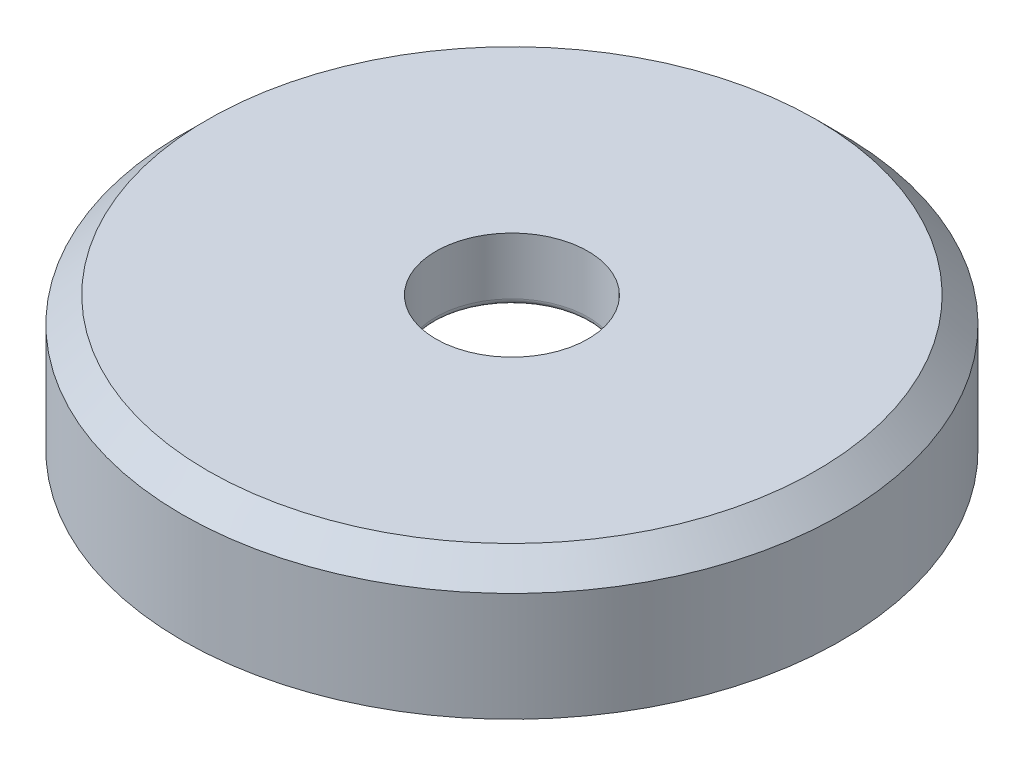
ISO-10303-21;
HEADER;
FILE_DESCRIPTION(('STEP AP214'),'2;1');
FILE_NAME('part.step','',(''),(''),'','','');
FILE_SCHEMA(('AUTOMOTIVE_DESIGN { 1 0 10303 214 1 1 1 1 }'));
ENDSEC;
DATA;
#1=APPLICATION_CONTEXT('core data for automotive mechanical design processes');
#2=APPLICATION_PROTOCOL_DEFINITION('international standard','automotive_design',2000,#1);
#3=PRODUCT_CONTEXT('',#1,'mechanical');
#4=PRODUCT('Part','Part','',(#3));
#5=PRODUCT_RELATED_PRODUCT_CATEGORY('part','',(#4));
#6=PRODUCT_DEFINITION_FORMATION('','',#4);
#7=PRODUCT_DEFINITION_CONTEXT('part definition',#1,'design');
#8=PRODUCT_DEFINITION('design','',#6,#7);
#9=PRODUCT_DEFINITION_SHAPE('','',#8);
#10=(LENGTH_UNIT() NAMED_UNIT(*) SI_UNIT(.MILLI.,.METRE.));
#11=(NAMED_UNIT(*) PLANE_ANGLE_UNIT() SI_UNIT($,.RADIAN.));
#12=(NAMED_UNIT(*) SI_UNIT($,.STERADIAN.) SOLID_ANGLE_UNIT());
#13=UNCERTAINTY_MEASURE_WITH_UNIT(LENGTH_MEASURE(1.E-05),#10,'distance_accuracy_value','');
#14=(GEOMETRIC_REPRESENTATION_CONTEXT(3) GLOBAL_UNCERTAINTY_ASSIGNED_CONTEXT((#13)) GLOBAL_UNIT_ASSIGNED_CONTEXT((#10,
#11,#12)) REPRESENTATION_CONTEXT('',''));
#15=CARTESIAN_POINT('',(0.,0.,0.));
#16=DIRECTION('',(0.,0.,1.));
#17=DIRECTION('',(1.,0.,0.));
#18=AXIS2_PLACEMENT_3D('',#15,#16,#17);
#19=CARTESIAN_POINT('',(0.,0.,0.));
#20=DIRECTION('',(0.,1.,0.));
#21=DIRECTION('',(0.,0.,1.));
#22=AXIS2_PLACEMENT_3D('',#19,#20,#21);
#23=PLANE('',#22);
#24=CARTESIAN_POINT('',(0.,0.,0.));
#25=DIRECTION('',(0.,1.,0.));
#26=DIRECTION('',(0.,0.,1.));
#27=AXIS2_PLACEMENT_3D('',#24,#25,#26);
#28=CIRCLE('',#27,13.);
#29=CARTESIAN_POINT('',(0.,0.,13.));
#30=VERTEX_POINT('',#29);
#31=EDGE_CURVE('E138',#30,#30,#28,.T.);
#32=ORIENTED_EDGE('',*,*,#31,.F.);
#33=EDGE_LOOP('',(#32));
#34=FACE_BOUND('',#33,.T.);
#35=DIRECTION('',(0.866025403784439,0.,0.5));
#36=VECTOR('',#35,1.);
#37=CARTESIAN_POINT('',(-8.625,0.,4.97964607176052));
#38=LINE('',#37,#36);
#39=CARTESIAN_POINT('',(-8.625,0.,4.97964607176052));
#40=VERTEX_POINT('',#39);
#41=CARTESIAN_POINT('',(0.,0.,9.95929214352105));
#42=VERTEX_POINT('',#41);
#43=EDGE_CURVE('E57',#40,#42,#38,.T.);
#44=ORIENTED_EDGE('',*,*,#43,.T.);
#45=DIRECTION('',(0.866025403784439,0.,-0.5));
#46=VECTOR('',#45,1.);
#47=CARTESIAN_POINT('',(0.,0.,9.95929214352105));
#48=LINE('',#47,#46);
#49=CARTESIAN_POINT('',(8.625,0.,4.97964607176053));
#50=VERTEX_POINT('',#49);
#51=EDGE_CURVE('E117',#42,#50,#48,.T.);
#52=ORIENTED_EDGE('',*,*,#51,.T.);
#53=DIRECTION('',(0.,0.,-1.));
#54=VECTOR('',#53,1.);
#55=CARTESIAN_POINT('',(8.625,0.,4.97964607176053));
#56=LINE('',#55,#54);
#57=CARTESIAN_POINT('',(8.625,0.,-4.97964607176053));
#58=VERTEX_POINT('',#57);
#59=EDGE_CURVE('E113',#50,#58,#56,.T.);
#60=ORIENTED_EDGE('',*,*,#59,.T.);
#61=DIRECTION('',(-0.866025403784438,0.,-0.5));
#62=VECTOR('',#61,1.);
#63=CARTESIAN_POINT('',(8.625,0.,-4.97964607176053));
#64=LINE('',#63,#62);
#65=CARTESIAN_POINT('',(0.,0.,-9.95929214352105));
#66=VERTEX_POINT('',#65);
#67=EDGE_CURVE('E92',#58,#66,#64,.T.);
#68=ORIENTED_EDGE('',*,*,#67,.T.);
#69=DIRECTION('',(-0.866025403784439,0.,0.5));
#70=VECTOR('',#69,1.);
#71=CARTESIAN_POINT('',(0.,0.,-9.95929214352105));
#72=LINE('',#71,#70);
#73=CARTESIAN_POINT('',(-8.625,0.,-4.97964607176053));
#74=VERTEX_POINT('',#73);
#75=EDGE_CURVE('E102',#66,#74,#72,.T.);
#76=ORIENTED_EDGE('',*,*,#75,.T.);
#77=DIRECTION('',(0.,0.,1.));
#78=VECTOR('',#77,1.);
#79=CARTESIAN_POINT('',(-8.625,0.,-4.97964607176053));
#80=LINE('',#79,#78);
#81=EDGE_CURVE('E109',#74,#40,#80,.T.);
#82=ORIENTED_EDGE('',*,*,#81,.T.);
#83=EDGE_LOOP('',(#44,#52,#60,#68,#76,#82));
#84=FACE_BOUND('',#83,.T.);
#85=ADVANCED_FACE('F41',(#34,#84),#23,.F.);
#86=CARTESIAN_POINT('',(0.,2.8,0.));
#87=DIRECTION('',(0.,-1.,0.));
#88=DIRECTION('',(0.,0.,-1.));
#89=AXIS2_PLACEMENT_3D('',#86,#87,#88);
#90=CYLINDRICAL_SURFACE('',#89,13.);
#91=CARTESIAN_POINT('',(0.,4.29999999999999,0.));
#92=DIRECTION('',(0.,1.,0.));
#93=DIRECTION('',(0.,0.,1.));
#94=AXIS2_PLACEMENT_3D('',#91,#92,#93);
#95=CIRCLE('',#94,13.);
#96=CARTESIAN_POINT('',(0.,4.29999999999999,13.));
#97=VERTEX_POINT('',#96);
#98=EDGE_CURVE('E146',#97,#97,#95,.F.);
#99=ORIENTED_EDGE('',*,*,#98,.T.);
#100=EDGE_LOOP('',(#99));
#101=FACE_BOUND('',#100,.T.);
#102=ORIENTED_EDGE('',*,*,#31,.T.);
#103=EDGE_LOOP('',(#102));
#104=FACE_BOUND('',#103,.T.);
#105=ADVANCED_FACE('F165',(#101,#104),#90,.T.);
#106=CARTESIAN_POINT('',(-8.625,2.8,4.97964607176052));
#107=DIRECTION('',(0.5,0.,-0.866025403784439));
#108=DIRECTION('',(-0.866025403784439,0.,-0.5));
#109=AXIS2_PLACEMENT_3D('',#106,#107,#108);
#110=PLANE('',#109);
#111=ORIENTED_EDGE('',*,*,#43,.F.);
#112=DIRECTION('',(0.,-1.,0.));
#113=VECTOR('',#112,1.);
#114=CARTESIAN_POINT('',(-8.625,2.8,4.97964607176052));
#115=LINE('',#114,#113);
#116=CARTESIAN_POINT('',(-8.625,2.8,4.97964607176052));
#117=VERTEX_POINT('',#116);
#118=EDGE_CURVE('E124',#117,#40,#115,.T.);
#119=ORIENTED_EDGE('',*,*,#118,.F.);
#120=DIRECTION('',(0.866025403784439,0.,0.5));
#121=VECTOR('',#120,1.);
#122=CARTESIAN_POINT('',(-8.625,2.8,4.97964607176052));
#123=LINE('',#122,#121);
#124=CARTESIAN_POINT('',(0.,2.8,9.95929214352105));
#125=VERTEX_POINT('',#124);
#126=EDGE_CURVE('E123',#117,#125,#123,.T.);
#127=ORIENTED_EDGE('',*,*,#126,.T.);
#128=DIRECTION('',(0.,-1.,0.));
#129=VECTOR('',#128,1.);
#130=CARTESIAN_POINT('',(0.,2.8,9.95929214352105));
#131=LINE('',#130,#129);
#132=EDGE_CURVE('E135',#125,#42,#131,.T.);
#133=ORIENTED_EDGE('',*,*,#132,.T.);
#134=EDGE_LOOP('',(#111,#119,#127,#133));
#135=FACE_BOUND('',#134,.T.);
#136=ADVANCED_FACE('F171',(#135),#110,.T.);
#137=CARTESIAN_POINT('',(0.,2.8,9.95929214352105));
#138=DIRECTION('',(-0.5,0.,-0.866025403784439));
#139=DIRECTION('',(-0.866025403784439,0.,0.5));
#140=AXIS2_PLACEMENT_3D('',#137,#138,#139);
#141=PLANE('',#140);
#142=ORIENTED_EDGE('',*,*,#51,.F.);
#143=ORIENTED_EDGE('',*,*,#132,.F.);
#144=DIRECTION('',(0.866025403784439,0.,-0.5));
#145=VECTOR('',#144,1.);
#146=CARTESIAN_POINT('',(0.,2.8,9.95929214352105));
#147=LINE('',#146,#145);
#148=CARTESIAN_POINT('',(8.625,2.8,4.97964607176053));
#149=VERTEX_POINT('',#148);
#150=EDGE_CURVE('E220',#125,#149,#147,.T.);
#151=ORIENTED_EDGE('',*,*,#150,.T.);
#152=DIRECTION('',(0.,-1.,0.));
#153=VECTOR('',#152,1.);
#154=CARTESIAN_POINT('',(8.625,2.8,4.97964607176053));
#155=LINE('',#154,#153);
#156=EDGE_CURVE('E132',#149,#50,#155,.T.);
#157=ORIENTED_EDGE('',*,*,#156,.T.);
#158=EDGE_LOOP('',(#142,#143,#151,#157));
#159=FACE_BOUND('',#158,.T.);
#160=ADVANCED_FACE('F181',(#159),#141,.T.);
#161=CARTESIAN_POINT('',(8.625,2.8,4.97964607176053));
#162=DIRECTION('',(-1.,0.,0.));
#163=DIRECTION('',(0.,0.,1.));
#164=AXIS2_PLACEMENT_3D('',#161,#162,#163);
#165=PLANE('',#164);
#166=ORIENTED_EDGE('',*,*,#59,.F.);
#167=ORIENTED_EDGE('',*,*,#156,.F.);
#168=DIRECTION('',(0.,0.,-1.));
#169=VECTOR('',#168,1.);
#170=CARTESIAN_POINT('',(8.625,2.8,4.97964607176053));
#171=LINE('',#170,#169);
#172=CARTESIAN_POINT('',(8.625,2.8,-4.97964607176053));
#173=VERTEX_POINT('',#172);
#174=EDGE_CURVE('E224',#149,#173,#171,.T.);
#175=ORIENTED_EDGE('',*,*,#174,.T.);
#176=DIRECTION('',(0.,-1.,0.));
#177=VECTOR('',#176,1.);
#178=CARTESIAN_POINT('',(8.625,2.8,-4.97964607176053));
#179=LINE('',#178,#177);
#180=EDGE_CURVE('E98',#173,#58,#179,.T.);
#181=ORIENTED_EDGE('',*,*,#180,.T.);
#182=EDGE_LOOP('',(#166,#167,#175,#181));
#183=FACE_BOUND('',#182,.T.);
#184=ADVANCED_FACE('F184',(#183),#165,.T.);
#185=CARTESIAN_POINT('',(8.625,2.8,-4.97964607176053));
#186=DIRECTION('',(-0.5,0.,0.866025403784439));
#187=DIRECTION('',(0.866025403784439,0.,0.5));
#188=AXIS2_PLACEMENT_3D('',#185,#186,#187);
#189=PLANE('',#188);
#190=ORIENTED_EDGE('',*,*,#67,.F.);
#191=ORIENTED_EDGE('',*,*,#180,.F.);
#192=DIRECTION('',(-0.866025403784438,0.,-0.5));
#193=VECTOR('',#192,1.);
#194=CARTESIAN_POINT('',(8.625,2.8,-4.97964607176053));
#195=LINE('',#194,#193);
#196=CARTESIAN_POINT('',(0.,2.8,-9.95929214352105));
#197=VERTEX_POINT('',#196);
#198=EDGE_CURVE('E66',#173,#197,#195,.T.);
#199=ORIENTED_EDGE('',*,*,#198,.T.);
#200=DIRECTION('',(0.,-1.,0.));
#201=VECTOR('',#200,1.);
#202=CARTESIAN_POINT('',(0.,2.8,-9.95929214352105));
#203=LINE('',#202,#201);
#204=EDGE_CURVE('E87',#197,#66,#203,.T.);
#205=ORIENTED_EDGE('',*,*,#204,.T.);
#206=EDGE_LOOP('',(#190,#191,#199,#205));
#207=FACE_BOUND('',#206,.T.);
#208=ADVANCED_FACE('F89',(#207),#189,.T.);
#209=CARTESIAN_POINT('',(0.,2.8,-9.95929214352105));
#210=DIRECTION('',(0.5,0.,0.866025403784439));
#211=DIRECTION('',(0.866025403784439,0.,-0.5));
#212=AXIS2_PLACEMENT_3D('',#209,#210,#211);
#213=PLANE('',#212);
#214=ORIENTED_EDGE('',*,*,#75,.F.);
#215=ORIENTED_EDGE('',*,*,#204,.F.);
#216=DIRECTION('',(-0.866025403784439,0.,0.5));
#217=VECTOR('',#216,1.);
#218=CARTESIAN_POINT('',(0.,2.8,-9.95929214352105));
#219=LINE('',#218,#217);
#220=CARTESIAN_POINT('',(-8.625,2.8,-4.97964607176053));
#221=VERTEX_POINT('',#220);
#222=EDGE_CURVE('E229',#197,#221,#219,.T.);
#223=ORIENTED_EDGE('',*,*,#222,.T.);
#224=DIRECTION('',(0.,-1.,0.));
#225=VECTOR('',#224,1.);
#226=CARTESIAN_POINT('',(-8.625,2.8,-4.97964607176053));
#227=LINE('',#226,#225);
#228=EDGE_CURVE('E99',#221,#74,#227,.T.);
#229=ORIENTED_EDGE('',*,*,#228,.T.);
#230=EDGE_LOOP('',(#214,#215,#223,#229));
#231=FACE_BOUND('',#230,.T.);
#232=ADVANCED_FACE('F103',(#231),#213,.T.);
#233=CARTESIAN_POINT('',(-8.625,2.8,-4.97964607176053));
#234=DIRECTION('',(1.,0.,0.));
#235=DIRECTION('',(0.,0.,-1.));
#236=AXIS2_PLACEMENT_3D('',#233,#234,#235);
#237=PLANE('',#236);
#238=ORIENTED_EDGE('',*,*,#81,.F.);
#239=ORIENTED_EDGE('',*,*,#228,.F.);
#240=DIRECTION('',(0.,0.,1.));
#241=VECTOR('',#240,1.);
#242=CARTESIAN_POINT('',(-8.625,2.8,-4.97964607176053));
#243=LINE('',#242,#241);
#244=EDGE_CURVE('E127',#221,#117,#243,.T.);
#245=ORIENTED_EDGE('',*,*,#244,.T.);
#246=ORIENTED_EDGE('',*,*,#118,.T.);
#247=EDGE_LOOP('',(#238,#239,#245,#246));
#248=FACE_BOUND('',#247,.T.);
#249=ADVANCED_FACE('F193',(#248),#237,.T.);
#250=CARTESIAN_POINT('',(0.,5.3,0.));
#251=DIRECTION('',(0.,1.,0.));
#252=DIRECTION('',(0.,0.,1.));
#253=AXIS2_PLACEMENT_3D('',#250,#251,#252);
#254=PLANE('',#253);
#255=CARTESIAN_POINT('',(0.,5.3,0.));
#256=DIRECTION('',(0.,1.,0.));
#257=DIRECTION('',(0.,0.,1.));
#258=AXIS2_PLACEMENT_3D('',#255,#256,#257);
#259=CIRCLE('',#258,12.);
#260=CARTESIAN_POINT('',(0.,5.3,12.));
#261=VERTEX_POINT('',#260);
#262=EDGE_CURVE('E142',#261,#261,#259,.T.);
#263=ORIENTED_EDGE('',*,*,#262,.T.);
#264=EDGE_LOOP('',(#263));
#265=FACE_BOUND('',#264,.T.);
#266=CARTESIAN_POINT('',(0.,5.3,0.));
#267=DIRECTION('',(0.,1.,0.));
#268=DIRECTION('',(0.,0.,1.));
#269=AXIS2_PLACEMENT_3D('',#266,#267,#268);
#270=CIRCLE('',#269,3.);
#271=CARTESIAN_POINT('',(0.,5.3,3.));
#272=VERTEX_POINT('',#271);
#273=EDGE_CURVE('E210',#272,#272,#270,.T.);
#274=ORIENTED_EDGE('',*,*,#273,.F.);
#275=EDGE_LOOP('',(#274));
#276=FACE_BOUND('',#275,.T.);
#277=ADVANCED_FACE('F196',(#265,#276),#254,.T.);
#278=CARTESIAN_POINT('',(0.,2.8,0.));
#279=DIRECTION('',(0.,1.,0.));
#280=DIRECTION('',(0.,0.,1.));
#281=AXIS2_PLACEMENT_3D('',#278,#279,#280);
#282=PLANE('',#281);
#283=CARTESIAN_POINT('',(0.,2.8,0.));
#284=DIRECTION('',(0.,1.,0.));
#285=DIRECTION('',(0.,0.,1.));
#286=AXIS2_PLACEMENT_3D('',#283,#284,#285);
#287=CIRCLE('',#286,3.25);
#288=CARTESIAN_POINT('',(0.,2.8,3.25));
#289=VERTEX_POINT('',#288);
#290=EDGE_CURVE('E50',#289,#289,#287,.T.);
#291=ORIENTED_EDGE('',*,*,#290,.T.);
#292=EDGE_LOOP('',(#291));
#293=FACE_BOUND('',#292,.T.);
#294=ORIENTED_EDGE('',*,*,#150,.F.);
#295=ORIENTED_EDGE('',*,*,#126,.F.);
#296=ORIENTED_EDGE('',*,*,#244,.F.);
#297=ORIENTED_EDGE('',*,*,#222,.F.);
#298=ORIENTED_EDGE('',*,*,#198,.F.);
#299=ORIENTED_EDGE('',*,*,#174,.F.);
#300=EDGE_LOOP('',(#294,#295,#296,#297,#298,#299));
#301=FACE_BOUND('',#300,.T.);
#302=ADVANCED_FACE('F153',(#293,#301),#282,.F.);
#303=CARTESIAN_POINT('',(0.,5.3,0.));
#304=DIRECTION('',(0.,-1.,0.));
#305=DIRECTION('',(0.,0.,-1.));
#306=AXIS2_PLACEMENT_3D('',#303,#304,#305);
#307=CYLINDRICAL_SURFACE('',#306,3.);
#308=CARTESIAN_POINT('',(0.,3.05,0.));
#309=DIRECTION('',(0.,1.,0.));
#310=DIRECTION('',(0.,0.,1.));
#311=AXIS2_PLACEMENT_3D('',#308,#309,#310);
#312=CIRCLE('',#311,3.);
#313=CARTESIAN_POINT('',(0.,3.05,3.));
#314=VERTEX_POINT('',#313);
#315=EDGE_CURVE('E11',#314,#314,#312,.F.);
#316=ORIENTED_EDGE('',*,*,#315,.T.);
#317=EDGE_LOOP('',(#316));
#318=FACE_BOUND('',#317,.T.);
#319=ORIENTED_EDGE('',*,*,#273,.T.);
#320=EDGE_LOOP('',(#319));
#321=FACE_BOUND('',#320,.T.);
#322=ADVANCED_FACE('F161',(#318,#321),#307,.F.);
#323=CARTESIAN_POINT('',(0.,5.3,0.));
#324=DIRECTION('',(0.,-1.,0.));
#325=DIRECTION('',(0.,0.,-1.));
#326=AXIS2_PLACEMENT_3D('',#323,#324,#325);
#327=CONICAL_SURFACE('',#326,12.,0.785398163397445);
#328=ORIENTED_EDGE('',*,*,#98,.F.);
#329=EDGE_LOOP('',(#328));
#330=FACE_BOUND('',#329,.T.);
#331=ORIENTED_EDGE('',*,*,#262,.F.);
#332=EDGE_LOOP('',(#331));
#333=FACE_BOUND('',#332,.T.);
#334=ADVANCED_FACE('F156',(#330,#333),#327,.T.);
#335=CARTESIAN_POINT('',(0.,3.05,0.));
#336=DIRECTION('',(0.,1.,0.));
#337=DIRECTION('',(0.,0.,1.));
#338=AXIS2_PLACEMENT_3D('',#335,#336,#337);
#339=TOROIDAL_SURFACE('',#338,3.25,0.25);
#340=ORIENTED_EDGE('',*,*,#315,.F.);
#341=EDGE_LOOP('',(#340));
#342=FACE_BOUND('',#341,.T.);
#343=ORIENTED_EDGE('',*,*,#290,.F.);
#344=EDGE_LOOP('',(#343));
#345=FACE_BOUND('',#344,.T.);
#346=ADVANCED_FACE('F43',(#342,#345),#339,.T.);
#347=CLOSED_SHELL('',(#85,#105,#136,#160,#184,#208,#232,#249,#277,#302,#322,#334,#346));
#348=MANIFOLD_SOLID_BREP('B2',#347);
#349=ADVANCED_BREP_SHAPE_REPRESENTATION('',(#18,#348),#14);
#350=SHAPE_DEFINITION_REPRESENTATION(#9,#349);
ENDSEC;
END-ISO-10303-21;
